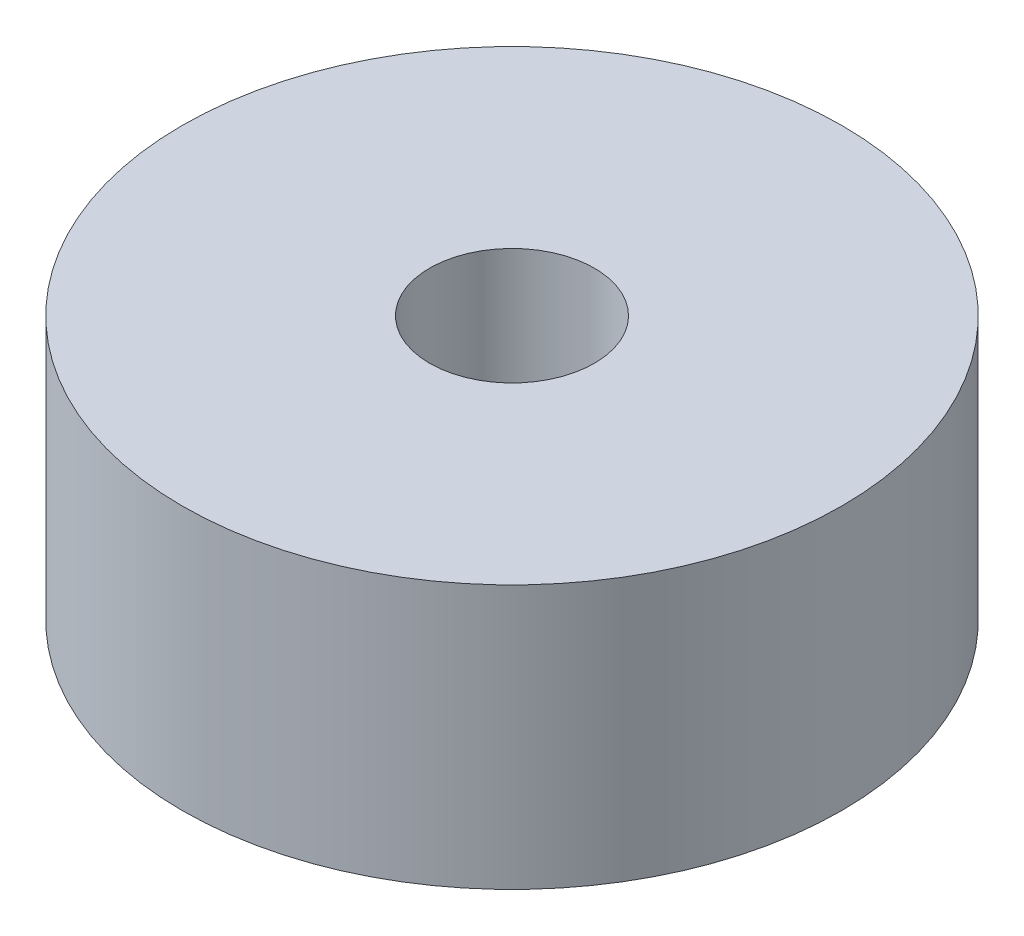
ISO-10303-21;
HEADER;
FILE_DESCRIPTION(('STEP AP214'),'2;1');
FILE_NAME('part.step','',(''),(''),'','','');
FILE_SCHEMA(('AUTOMOTIVE_DESIGN { 1 0 10303 214 1 1 1 1 }'));
ENDSEC;
DATA;
#1=APPLICATION_CONTEXT('core data for automotive mechanical design processes');
#2=APPLICATION_PROTOCOL_DEFINITION('international standard','automotive_design',2000,#1);
#3=PRODUCT_CONTEXT('',#1,'mechanical');
#4=PRODUCT('Part','Part','',(#3));
#5=PRODUCT_RELATED_PRODUCT_CATEGORY('part','',(#4));
#6=PRODUCT_DEFINITION_FORMATION('','',#4);
#7=PRODUCT_DEFINITION_CONTEXT('part definition',#1,'design');
#8=PRODUCT_DEFINITION('design','',#6,#7);
#9=PRODUCT_DEFINITION_SHAPE('','',#8);
#10=(LENGTH_UNIT() NAMED_UNIT(*) SI_UNIT(.MILLI.,.METRE.));
#11=(NAMED_UNIT(*) PLANE_ANGLE_UNIT() SI_UNIT($,.RADIAN.));
#12=(NAMED_UNIT(*) SI_UNIT($,.STERADIAN.) SOLID_ANGLE_UNIT());
#13=UNCERTAINTY_MEASURE_WITH_UNIT(LENGTH_MEASURE(1.E-05),#10,'distance_accuracy_value','');
#14=(GEOMETRIC_REPRESENTATION_CONTEXT(3) GLOBAL_UNCERTAINTY_ASSIGNED_CONTEXT((#13)) GLOBAL_UNIT_ASSIGNED_CONTEXT((#10,
#11,#12)) REPRESENTATION_CONTEXT('',''));
#15=CARTESIAN_POINT('',(0.,0.,0.));
#16=DIRECTION('',(0.,0.,1.));
#17=DIRECTION('',(1.,0.,0.));
#18=AXIS2_PLACEMENT_3D('',#15,#16,#17);
#19=CARTESIAN_POINT('',(0.,20.32,0.));
#20=DIRECTION('',(0.,1.,0.));
#21=DIRECTION('',(0.,0.,1.));
#22=AXIS2_PLACEMENT_3D('',#19,#20,#21);
#23=PLANE('',#22);
#24=CARTESIAN_POINT('',(0.,20.32,0.));
#25=DIRECTION('',(0.,1.,0.));
#26=DIRECTION('',(0.,0.,1.));
#27=AXIS2_PLACEMENT_3D('',#24,#25,#26);
#28=CIRCLE('',#27,25.4);
#29=CARTESIAN_POINT('',(0.,20.32,25.4));
#30=VERTEX_POINT('',#29);
#31=EDGE_CURVE('E10',#30,#30,#28,.T.);
#32=ORIENTED_EDGE('',*,*,#31,.T.);
#33=EDGE_LOOP('',(#32));
#34=FACE_BOUND('',#33,.T.);
#35=CARTESIAN_POINT('',(0.,20.32,0.));
#36=DIRECTION('',(0.,1.,0.));
#37=DIRECTION('',(0.,0.,1.));
#38=AXIS2_PLACEMENT_3D('',#35,#36,#37);
#39=CIRCLE('',#38,6.35);
#40=CARTESIAN_POINT('',(0.,20.32,6.35));
#41=VERTEX_POINT('',#40);
#42=EDGE_CURVE('E52',#41,#41,#39,.T.);
#43=ORIENTED_EDGE('',*,*,#42,.F.);
#44=EDGE_LOOP('',(#43));
#45=FACE_BOUND('',#44,.T.);
#46=ADVANCED_FACE('F39',(#34,#45),#23,.T.);
#47=CARTESIAN_POINT('',(0.,0.,0.));
#48=DIRECTION('',(0.,1.,0.));
#49=DIRECTION('',(0.,0.,1.));
#50=AXIS2_PLACEMENT_3D('',#47,#48,#49);
#51=PLANE('',#50);
#52=CARTESIAN_POINT('',(0.,0.,0.));
#53=DIRECTION('',(0.,1.,0.));
#54=DIRECTION('',(0.,0.,1.));
#55=AXIS2_PLACEMENT_3D('',#52,#53,#54);
#56=CIRCLE('',#55,25.4);
#57=CARTESIAN_POINT('',(0.,0.,25.4));
#58=VERTEX_POINT('',#57);
#59=EDGE_CURVE('E43',#58,#58,#56,.T.);
#60=ORIENTED_EDGE('',*,*,#59,.F.);
#61=EDGE_LOOP('',(#60));
#62=FACE_BOUND('',#61,.T.);
#63=CARTESIAN_POINT('',(0.,0.,0.));
#64=DIRECTION('',(0.,1.,0.));
#65=DIRECTION('',(0.,0.,1.));
#66=AXIS2_PLACEMENT_3D('',#63,#64,#65);
#67=CIRCLE('',#66,6.35);
#68=CARTESIAN_POINT('',(0.,0.,6.35));
#69=VERTEX_POINT('',#68);
#70=EDGE_CURVE('E54',#69,#69,#67,.T.);
#71=ORIENTED_EDGE('',*,*,#70,.T.);
#72=EDGE_LOOP('',(#71));
#73=FACE_BOUND('',#72,.T.);
#74=ADVANCED_FACE('F66',(#62,#73),#51,.F.);
#75=CARTESIAN_POINT('',(0.,20.32,0.));
#76=DIRECTION('',(0.,-1.,0.));
#77=DIRECTION('',(0.,0.,-1.));
#78=AXIS2_PLACEMENT_3D('',#75,#76,#77);
#79=CYLINDRICAL_SURFACE('',#78,25.4);
#80=ORIENTED_EDGE('',*,*,#31,.F.);
#81=EDGE_LOOP('',(#80));
#82=FACE_BOUND('',#81,.T.);
#83=ORIENTED_EDGE('',*,*,#59,.T.);
#84=EDGE_LOOP('',(#83));
#85=FACE_BOUND('',#84,.T.);
#86=ADVANCED_FACE('F41',(#82,#85),#79,.T.);
#87=CARTESIAN_POINT('',(0.,20.32,0.));
#88=DIRECTION('',(0.,-1.,0.));
#89=DIRECTION('',(0.,0.,-1.));
#90=AXIS2_PLACEMENT_3D('',#87,#88,#89);
#91=CYLINDRICAL_SURFACE('',#90,6.35);
#92=ORIENTED_EDGE('',*,*,#42,.T.);
#93=EDGE_LOOP('',(#92));
#94=FACE_BOUND('',#93,.T.);
#95=ORIENTED_EDGE('',*,*,#70,.F.);
#96=EDGE_LOOP('',(#95));
#97=FACE_BOUND('',#96,.T.);
#98=ADVANCED_FACE('F62',(#94,#97),#91,.F.);
#99=CLOSED_SHELL('',(#46,#74,#86,#98));
#100=MANIFOLD_SOLID_BREP('B2',#99);
#101=ADVANCED_BREP_SHAPE_REPRESENTATION('',(#18,#100),#14);
#102=SHAPE_DEFINITION_REPRESENTATION(#9,#101);
ENDSEC;
END-ISO-10303-21;
